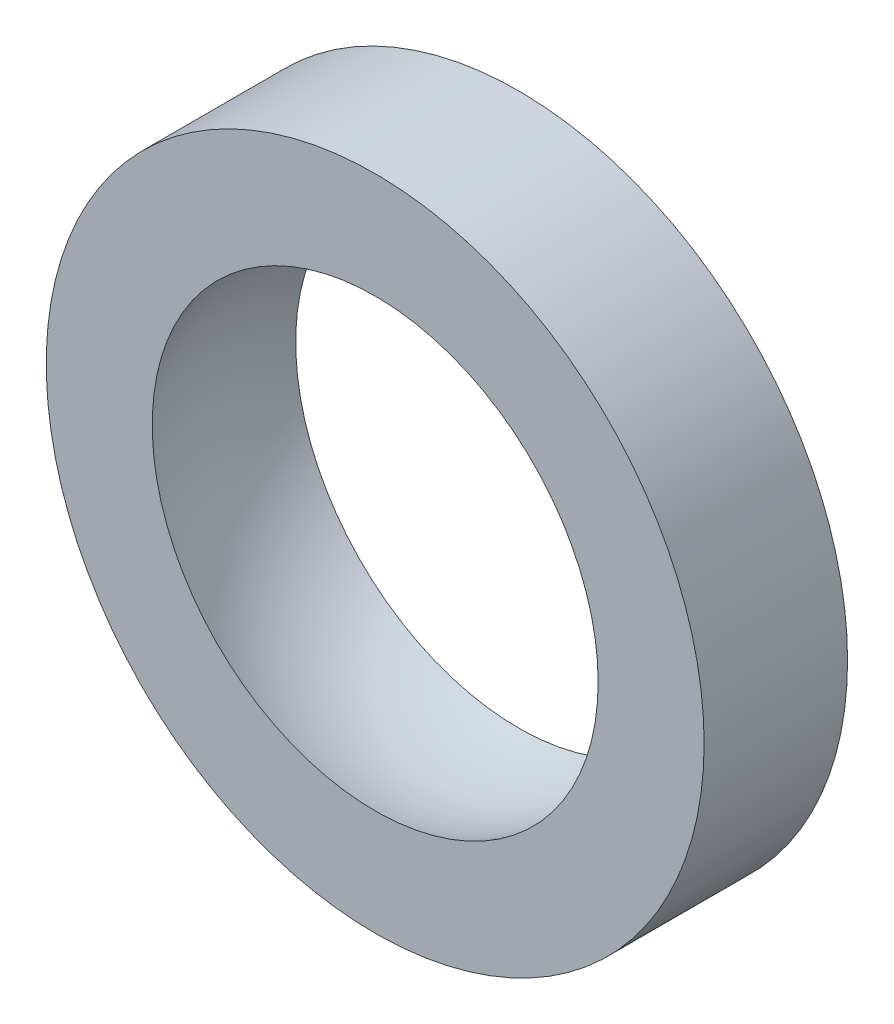
ISO-10303-21;
HEADER;
FILE_DESCRIPTION(('STEP AP214'),'2;1');
FILE_NAME('part.step','',(''),(''),'','','');
FILE_SCHEMA(('AUTOMOTIVE_DESIGN { 1 0 10303 214 1 1 1 1 }'));
ENDSEC;
DATA;
#1=APPLICATION_CONTEXT('core data for automotive mechanical design processes');
#2=APPLICATION_PROTOCOL_DEFINITION('international standard','automotive_design',2000,#1);
#3=PRODUCT_CONTEXT('',#1,'mechanical');
#4=PRODUCT('Part','Part','',(#3));
#5=PRODUCT_RELATED_PRODUCT_CATEGORY('part','',(#4));
#6=PRODUCT_DEFINITION_FORMATION('','',#4);
#7=PRODUCT_DEFINITION_CONTEXT('part definition',#1,'design');
#8=PRODUCT_DEFINITION('design','',#6,#7);
#9=PRODUCT_DEFINITION_SHAPE('','',#8);
#10=(LENGTH_UNIT() NAMED_UNIT(*) SI_UNIT(.MILLI.,.METRE.));
#11=(NAMED_UNIT(*) PLANE_ANGLE_UNIT() SI_UNIT($,.RADIAN.));
#12=(NAMED_UNIT(*) SI_UNIT($,.STERADIAN.) SOLID_ANGLE_UNIT());
#13=UNCERTAINTY_MEASURE_WITH_UNIT(LENGTH_MEASURE(1.E-05),#10,'distance_accuracy_value','');
#14=(GEOMETRIC_REPRESENTATION_CONTEXT(3) GLOBAL_UNCERTAINTY_ASSIGNED_CONTEXT((#13)) GLOBAL_UNIT_ASSIGNED_CONTEXT((#10,
#11,#12)) REPRESENTATION_CONTEXT('',''));
#15=CARTESIAN_POINT('',(0.,0.,0.));
#16=DIRECTION('',(0.,0.,1.));
#17=DIRECTION('',(1.,0.,0.));
#18=AXIS2_PLACEMENT_3D('',#15,#16,#17);
#19=CARTESIAN_POINT('',(0.,0.,0.));
#20=DIRECTION('',(0.,0.,1.));
#21=DIRECTION('',(0.,-1.,0.));
#22=AXIS2_PLACEMENT_3D('',#19,#20,#21);
#23=SPHERICAL_SURFACE('',#22,4.7625);
#24=CARTESIAN_POINT('',(0.,0.,1.4583393796716));
#25=DIRECTION('',(0.,0.,1.));
#26=DIRECTION('',(1.,0.,0.));
#27=AXIS2_PLACEMENT_3D('',#24,#25,#26);
#28=CIRCLE('',#27,4.53372391127857);
#29=CARTESIAN_POINT('',(4.53372391127857,0.,1.4583393796716));
#30=VERTEX_POINT('',#29);
#31=EDGE_CURVE('E10',#30,#30,#28,.T.);
#32=ORIENTED_EDGE('',*,*,#31,.T.);
#33=EDGE_LOOP('',(#32));
#34=FACE_BOUND('',#33,.T.);
#35=CARTESIAN_POINT('',(0.,0.,-1.4583393796716));
#36=DIRECTION('',(0.,0.,1.));
#37=DIRECTION('',(1.,0.,0.));
#38=AXIS2_PLACEMENT_3D('',#35,#36,#37);
#39=CIRCLE('',#38,4.53372391127857);
#40=CARTESIAN_POINT('',(4.53372391127857,0.,-1.4583393796716));
#41=VERTEX_POINT('',#40);
#42=EDGE_CURVE('E46',#41,#41,#39,.T.);
#43=ORIENTED_EDGE('',*,*,#42,.F.);
#44=EDGE_LOOP('',(#43));
#45=FACE_BOUND('',#44,.T.);
#46=ADVANCED_FACE('F32',(#34,#45),#23,.F.);
#47=CARTESIAN_POINT('',(0.,-4.53372391127857,1.4583393796716));
#48=DIRECTION('',(0.,0.,1.));
#49=DIRECTION('',(1.,0.,0.));
#50=AXIS2_PLACEMENT_3D('',#47,#48,#49);
#51=PLANE('',#50);
#52=CARTESIAN_POINT('',(0.,0.,1.4583393796716));
#53=DIRECTION('',(0.,0.,1.));
#54=DIRECTION('',(1.,0.,0.));
#55=AXIS2_PLACEMENT_3D('',#52,#53,#54);
#56=CIRCLE('',#55,6.68863050280397);
#57=CARTESIAN_POINT('',(6.68863050280397,0.,1.4583393796716));
#58=VERTEX_POINT('',#57);
#59=EDGE_CURVE('E38',#58,#58,#56,.T.);
#60=ORIENTED_EDGE('',*,*,#59,.T.);
#61=EDGE_LOOP('',(#60));
#62=FACE_BOUND('',#61,.T.);
#63=ORIENTED_EDGE('',*,*,#31,.F.);
#64=EDGE_LOOP('',(#63));
#65=FACE_BOUND('',#64,.T.);
#66=ADVANCED_FACE('F56',(#62,#65),#51,.T.);
#67=CARTESIAN_POINT('',(0.,0.,15.3142760628384));
#68=DIRECTION('',(0.,0.,1.));
#69=DIRECTION('',(1.,0.,0.));
#70=AXIS2_PLACEMENT_3D('',#67,#68,#69);
#71=CYLINDRICAL_SURFACE('',#70,6.68863050280397);
#72=CARTESIAN_POINT('',(0.,0.,-1.4583393796716));
#73=DIRECTION('',(0.,0.,1.));
#74=DIRECTION('',(1.,0.,0.));
#75=AXIS2_PLACEMENT_3D('',#72,#73,#74);
#76=CIRCLE('',#75,6.68863050280397);
#77=CARTESIAN_POINT('',(6.68863050280397,0.,-1.4583393796716));
#78=VERTEX_POINT('',#77);
#79=EDGE_CURVE('E42',#78,#78,#76,.T.);
#80=ORIENTED_EDGE('',*,*,#79,.T.);
#81=EDGE_LOOP('',(#80));
#82=FACE_BOUND('',#81,.T.);
#83=ORIENTED_EDGE('',*,*,#59,.F.);
#84=EDGE_LOOP('',(#83));
#85=FACE_BOUND('',#84,.T.);
#86=ADVANCED_FACE('F60',(#82,#85),#71,.T.);
#87=CARTESIAN_POINT('',(0.,-6.68863050280397,-1.4583393796716));
#88=DIRECTION('',(0.,0.,-1.));
#89=DIRECTION('',(-1.,0.,0.));
#90=AXIS2_PLACEMENT_3D('',#87,#88,#89);
#91=PLANE('',#90);
#92=ORIENTED_EDGE('',*,*,#42,.T.);
#93=EDGE_LOOP('',(#92));
#94=FACE_BOUND('',#93,.T.);
#95=ORIENTED_EDGE('',*,*,#79,.F.);
#96=EDGE_LOOP('',(#95));
#97=FACE_BOUND('',#96,.T.);
#98=ADVANCED_FACE('F52',(#94,#97),#91,.T.);
#99=CLOSED_SHELL('',(#46,#66,#86,#98));
#100=MANIFOLD_SOLID_BREP('B2',#99);
#101=ADVANCED_BREP_SHAPE_REPRESENTATION('',(#18,#100),#14);
#102=SHAPE_DEFINITION_REPRESENTATION(#9,#101);
ENDSEC;
END-ISO-10303-21;
